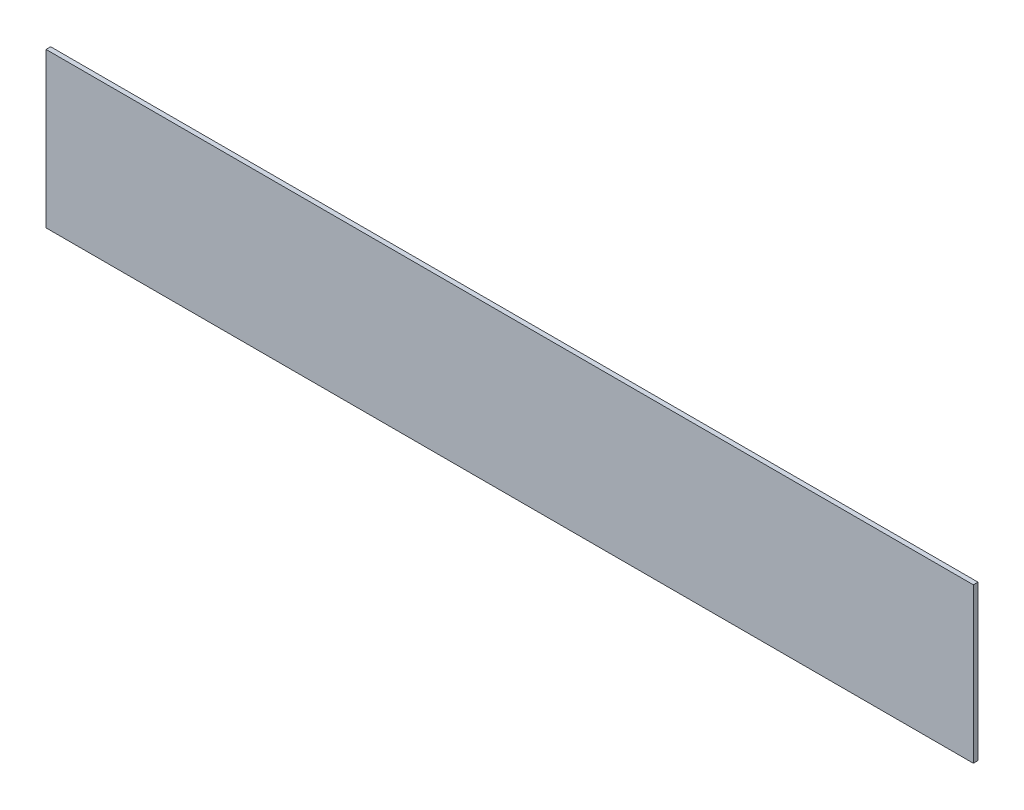
ISO-10303-21;
HEADER;
FILE_DESCRIPTION(('STEP AP214'),'2;1');
FILE_NAME('part.step','',(''),(''),'','','');
FILE_SCHEMA(('AUTOMOTIVE_DESIGN { 1 0 10303 214 1 1 1 1 }'));
ENDSEC;
DATA;
#1=APPLICATION_CONTEXT('core data for automotive mechanical design processes');
#2=APPLICATION_PROTOCOL_DEFINITION('international standard','automotive_design',2000,#1);
#3=PRODUCT_CONTEXT('',#1,'mechanical');
#4=PRODUCT('Part','Part','',(#3));
#5=PRODUCT_RELATED_PRODUCT_CATEGORY('part','',(#4));
#6=PRODUCT_DEFINITION_FORMATION('','',#4);
#7=PRODUCT_DEFINITION_CONTEXT('part definition',#1,'design');
#8=PRODUCT_DEFINITION('design','',#6,#7);
#9=PRODUCT_DEFINITION_SHAPE('','',#8);
#10=(LENGTH_UNIT() NAMED_UNIT(*) SI_UNIT(.MILLI.,.METRE.));
#11=(NAMED_UNIT(*) PLANE_ANGLE_UNIT() SI_UNIT($,.RADIAN.));
#12=(NAMED_UNIT(*) SI_UNIT($,.STERADIAN.) SOLID_ANGLE_UNIT());
#13=UNCERTAINTY_MEASURE_WITH_UNIT(LENGTH_MEASURE(1.E-05),#10,'distance_accuracy_value','');
#14=(GEOMETRIC_REPRESENTATION_CONTEXT(3) GLOBAL_UNCERTAINTY_ASSIGNED_CONTEXT((#13)) GLOBAL_UNIT_ASSIGNED_CONTEXT((#10,
#11,#12)) REPRESENTATION_CONTEXT('',''));
#15=CARTESIAN_POINT('',(0.,0.,0.));
#16=DIRECTION('',(0.,0.,1.));
#17=DIRECTION('',(1.,0.,0.));
#18=AXIS2_PLACEMENT_3D('',#15,#16,#17);
#19=CARTESIAN_POINT('',(0.,0.,3.));
#20=DIRECTION('',(1.,0.,0.));
#21=DIRECTION('',(0.,0.,-1.));
#22=AXIS2_PLACEMENT_3D('',#19,#20,#21);
#23=PLANE('',#22);
#24=DIRECTION('',(0.,-1.,0.));
#25=VECTOR('',#24,1.);
#26=CARTESIAN_POINT('',(0.,0.,0.));
#27=LINE('',#26,#25);
#28=CARTESIAN_POINT('',(0.,100.,0.));
#29=VERTEX_POINT('',#28);
#30=CARTESIAN_POINT('',(0.,0.,0.));
#31=VERTEX_POINT('',#30);
#32=EDGE_CURVE('E102',#29,#31,#27,.T.);
#33=ORIENTED_EDGE('',*,*,#32,.T.);
#34=DIRECTION('',(0.,0.,-1.));
#35=VECTOR('',#34,1.);
#36=CARTESIAN_POINT('',(0.,0.,3.));
#37=LINE('',#36,#35);
#38=CARTESIAN_POINT('',(0.,0.,3.));
#39=VERTEX_POINT('',#38);
#40=EDGE_CURVE('E11',#39,#31,#37,.T.);
#41=ORIENTED_EDGE('',*,*,#40,.F.);
#42=DIRECTION('',(0.,-1.,0.));
#43=VECTOR('',#42,1.);
#44=CARTESIAN_POINT('',(0.,0.,3.));
#45=LINE('',#44,#43);
#46=CARTESIAN_POINT('',(0.,100.,3.));
#47=VERTEX_POINT('',#46);
#48=EDGE_CURVE('E90',#47,#39,#45,.T.);
#49=ORIENTED_EDGE('',*,*,#48,.F.);
#50=DIRECTION('',(0.,0.,-1.));
#51=VECTOR('',#50,1.);
#52=CARTESIAN_POINT('',(0.,100.,3.));
#53=LINE('',#52,#51);
#54=EDGE_CURVE('E98',#47,#29,#53,.T.);
#55=ORIENTED_EDGE('',*,*,#54,.T.);
#56=EDGE_LOOP('',(#33,#41,#49,#55));
#57=FACE_BOUND('',#56,.T.);
#58=ADVANCED_FACE('F39',(#57),#23,.F.);
#59=CARTESIAN_POINT('',(0.,0.,3.));
#60=DIRECTION('',(0.,1.,0.));
#61=DIRECTION('',(0.,0.,1.));
#62=AXIS2_PLACEMENT_3D('',#59,#60,#61);
#63=PLANE('',#62);
#64=DIRECTION('',(1.,0.,0.));
#65=VECTOR('',#64,1.);
#66=CARTESIAN_POINT('',(0.,0.,0.));
#67=LINE('',#66,#65);
#68=CARTESIAN_POINT('',(600.,0.,0.));
#69=VERTEX_POINT('',#68);
#70=EDGE_CURVE('E94',#31,#69,#67,.T.);
#71=ORIENTED_EDGE('',*,*,#70,.T.);
#72=DIRECTION('',(0.,0.,-1.));
#73=VECTOR('',#72,1.);
#74=CARTESIAN_POINT('',(600.,0.,3.));
#75=LINE('',#74,#73);
#76=CARTESIAN_POINT('',(600.,0.,3.));
#77=VERTEX_POINT('',#76);
#78=EDGE_CURVE('E47',#77,#69,#75,.T.);
#79=ORIENTED_EDGE('',*,*,#78,.F.);
#80=DIRECTION('',(1.,0.,0.));
#81=VECTOR('',#80,1.);
#82=CARTESIAN_POINT('',(0.,0.,3.));
#83=LINE('',#82,#81);
#84=EDGE_CURVE('E85',#39,#77,#83,.T.);
#85=ORIENTED_EDGE('',*,*,#84,.F.);
#86=ORIENTED_EDGE('',*,*,#40,.T.);
#87=EDGE_LOOP('',(#71,#79,#85,#86));
#88=FACE_BOUND('',#87,.T.);
#89=ADVANCED_FACE('F93',(#88),#63,.F.);
#90=CARTESIAN_POINT('',(600.,0.,3.));
#91=DIRECTION('',(-1.,0.,0.));
#92=DIRECTION('',(0.,0.,1.));
#93=AXIS2_PLACEMENT_3D('',#90,#91,#92);
#94=PLANE('',#93);
#95=DIRECTION('',(0.,1.,0.));
#96=VECTOR('',#95,1.);
#97=CARTESIAN_POINT('',(600.,0.,0.));
#98=LINE('',#97,#96);
#99=CARTESIAN_POINT('',(600.,100.,0.));
#100=VERTEX_POINT('',#99);
#101=EDGE_CURVE('E72',#69,#100,#98,.T.);
#102=ORIENTED_EDGE('',*,*,#101,.T.);
#103=DIRECTION('',(0.,0.,-1.));
#104=VECTOR('',#103,1.);
#105=CARTESIAN_POINT('',(600.,100.,3.));
#106=LINE('',#105,#104);
#107=CARTESIAN_POINT('',(600.,100.,3.));
#108=VERTEX_POINT('',#107);
#109=EDGE_CURVE('E95',#108,#100,#106,.T.);
#110=ORIENTED_EDGE('',*,*,#109,.F.);
#111=DIRECTION('',(0.,1.,0.));
#112=VECTOR('',#111,1.);
#113=CARTESIAN_POINT('',(600.,0.,3.));
#114=LINE('',#113,#112);
#115=EDGE_CURVE('E88',#77,#108,#114,.T.);
#116=ORIENTED_EDGE('',*,*,#115,.F.);
#117=ORIENTED_EDGE('',*,*,#78,.T.);
#118=EDGE_LOOP('',(#102,#110,#116,#117));
#119=FACE_BOUND('',#118,.T.);
#120=ADVANCED_FACE('F96',(#119),#94,.F.);
#121=CARTESIAN_POINT('',(0.,100.,3.));
#122=DIRECTION('',(0.,-1.,0.));
#123=DIRECTION('',(1.,0.,0.));
#124=AXIS2_PLACEMENT_3D('',#121,#122,#123);
#125=PLANE('',#124);
#126=DIRECTION('',(-1.,0.,0.));
#127=VECTOR('',#126,1.);
#128=CARTESIAN_POINT('',(0.,100.,0.));
#129=LINE('',#128,#127);
#130=EDGE_CURVE('E78',#100,#29,#129,.T.);
#131=ORIENTED_EDGE('',*,*,#130,.T.);
#132=ORIENTED_EDGE('',*,*,#54,.F.);
#133=DIRECTION('',(-1.,0.,0.));
#134=VECTOR('',#133,1.);
#135=CARTESIAN_POINT('',(0.,100.,3.));
#136=LINE('',#135,#134);
#137=EDGE_CURVE('E55',#108,#47,#136,.T.);
#138=ORIENTED_EDGE('',*,*,#137,.F.);
#139=ORIENTED_EDGE('',*,*,#109,.T.);
#140=EDGE_LOOP('',(#131,#132,#138,#139));
#141=FACE_BOUND('',#140,.T.);
#142=ADVANCED_FACE('F109',(#141),#125,.F.);
#143=CARTESIAN_POINT('',(0.,0.,3.));
#144=DIRECTION('',(0.,0.,-1.));
#145=DIRECTION('',(-1.,0.,0.));
#146=AXIS2_PLACEMENT_3D('',#143,#144,#145);
#147=PLANE('',#146);
#148=ORIENTED_EDGE('',*,*,#48,.T.);
#149=ORIENTED_EDGE('',*,*,#84,.T.);
#150=ORIENTED_EDGE('',*,*,#115,.T.);
#151=ORIENTED_EDGE('',*,*,#137,.T.);
#152=EDGE_LOOP('',(#148,#149,#150,#151));
#153=FACE_BOUND('',#152,.T.);
#154=ADVANCED_FACE('F86',(#153),#147,.F.);
#155=CARTESIAN_POINT('',(0.,0.,0.));
#156=DIRECTION('',(0.,0.,-1.));
#157=DIRECTION('',(-1.,0.,0.));
#158=AXIS2_PLACEMENT_3D('',#155,#156,#157);
#159=PLANE('',#158);
#160=ORIENTED_EDGE('',*,*,#32,.F.);
#161=ORIENTED_EDGE('',*,*,#130,.F.);
#162=ORIENTED_EDGE('',*,*,#101,.F.);
#163=ORIENTED_EDGE('',*,*,#70,.F.);
#164=EDGE_LOOP('',(#160,#161,#162,#163));
#165=FACE_BOUND('',#164,.T.);
#166=ADVANCED_FACE('F112',(#165),#159,.T.);
#167=CLOSED_SHELL('',(#58,#89,#120,#142,#154,#166));
#168=MANIFOLD_SOLID_BREP('B2',#167);
#169=ADVANCED_BREP_SHAPE_REPRESENTATION('',(#18,#168),#14);
#170=SHAPE_DEFINITION_REPRESENTATION(#9,#169);
ENDSEC;
END-ISO-10303-21;
